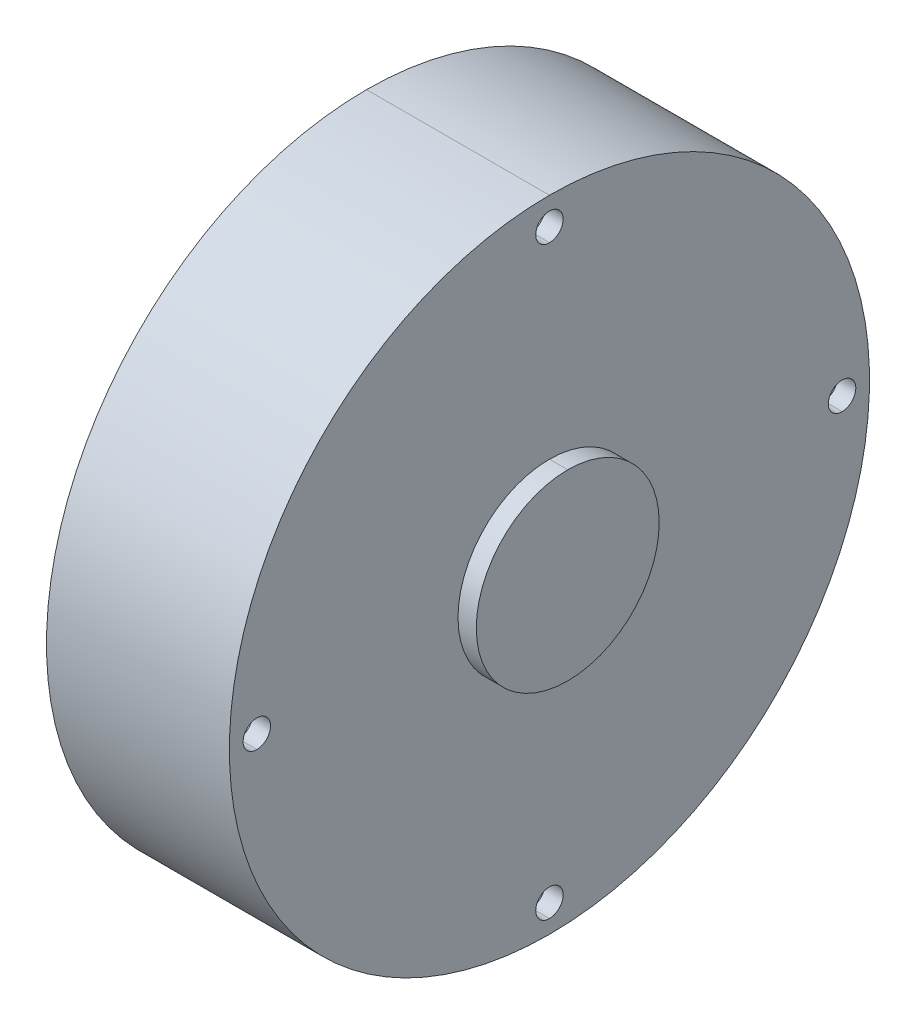
ISO-10303-21;
HEADER;
FILE_DESCRIPTION(('STEP AP214'),'2;1');
FILE_NAME('part.step','',(''),(''),'','','');
FILE_SCHEMA(('AUTOMOTIVE_DESIGN { 1 0 10303 214 1 1 1 1 }'));
ENDSEC;
DATA;
#1=APPLICATION_CONTEXT('core data for automotive mechanical design processes');
#2=APPLICATION_PROTOCOL_DEFINITION('international standard','automotive_design',2000,#1);
#3=PRODUCT_CONTEXT('',#1,'mechanical');
#4=PRODUCT('Part','Part','',(#3));
#5=PRODUCT_RELATED_PRODUCT_CATEGORY('part','',(#4));
#6=PRODUCT_DEFINITION_FORMATION('','',#4);
#7=PRODUCT_DEFINITION_CONTEXT('part definition',#1,'design');
#8=PRODUCT_DEFINITION('design','',#6,#7);
#9=PRODUCT_DEFINITION_SHAPE('','',#8);
#10=(LENGTH_UNIT() NAMED_UNIT(*) SI_UNIT(.MILLI.,.METRE.));
#11=(NAMED_UNIT(*) PLANE_ANGLE_UNIT() SI_UNIT($,.RADIAN.));
#12=(NAMED_UNIT(*) SI_UNIT($,.STERADIAN.) SOLID_ANGLE_UNIT());
#13=UNCERTAINTY_MEASURE_WITH_UNIT(LENGTH_MEASURE(1.E-05),#10,'distance_accuracy_value','');
#14=(GEOMETRIC_REPRESENTATION_CONTEXT(3) GLOBAL_UNCERTAINTY_ASSIGNED_CONTEXT((#13)) GLOBAL_UNIT_ASSIGNED_CONTEXT((#10,
#11,#12)) REPRESENTATION_CONTEXT('',''));
#15=CARTESIAN_POINT('',(0.,0.,0.));
#16=DIRECTION('',(0.,0.,1.));
#17=DIRECTION('',(1.,0.,0.));
#18=AXIS2_PLACEMENT_3D('',#15,#16,#17);
#19=CARTESIAN_POINT('',(44.232392983244,0.,0.));
#20=DIRECTION('',(-1.,0.,0.));
#21=DIRECTION('',(0.,1.,0.));
#22=AXIS2_PLACEMENT_3D('',#19,#20,#21);
#23=CYLINDRICAL_SURFACE('',#22,7.69230769133077);
#24=DIRECTION('',(1.,0.,0.));
#25=VECTOR('',#24,1.);
#26=CARTESIAN_POINT('',(44.232392983244,7.69230769133076,0.));
#27=LINE('',#26,#25);
#28=CARTESIAN_POINT('',(43.4631622141109,7.69230769133076,0.));
#29=VERTEX_POINT('',#28);
#30=CARTESIAN_POINT('',(45.0016237523771,7.69230769133076,0.));
#31=VERTEX_POINT('',#30);
#32=EDGE_CURVE('E72',#29,#31,#27,.T.);
#33=ORIENTED_EDGE('',*,*,#32,.F.);
#34=CARTESIAN_POINT('',(43.4631622141109,0.,0.));
#35=DIRECTION('',(1.,0.,0.));
#36=DIRECTION('',(0.,1.,0.));
#37=AXIS2_PLACEMENT_3D('',#34,#35,#36);
#38=CIRCLE('',#37,7.69230769133077);
#39=CARTESIAN_POINT('',(43.4631622141109,-7.69230769133078,0.));
#40=VERTEX_POINT('',#39);
#41=EDGE_CURVE('E11',#29,#40,#38,.T.);
#42=ORIENTED_EDGE('',*,*,#41,.T.);
#43=DIRECTION('',(1.,0.,0.));
#44=VECTOR('',#43,1.);
#45=CARTESIAN_POINT('',(44.232392983244,-7.69230769133078,0.));
#46=LINE('',#45,#44);
#47=CARTESIAN_POINT('',(45.0016237523771,-7.69230769133078,0.));
#48=VERTEX_POINT('',#47);
#49=EDGE_CURVE('E59',#40,#48,#46,.T.);
#50=ORIENTED_EDGE('',*,*,#49,.T.);
#51=CARTESIAN_POINT('',(45.0016237523771,0.,0.));
#52=DIRECTION('',(1.,0.,0.));
#53=DIRECTION('',(0.,1.,0.));
#54=AXIS2_PLACEMENT_3D('',#51,#52,#53);
#55=CIRCLE('',#54,7.69230769133077);
#56=EDGE_CURVE('E327',#31,#48,#55,.T.);
#57=ORIENTED_EDGE('',*,*,#56,.F.);
#58=EDGE_LOOP('',(#33,#42,#50,#57));
#59=FACE_BOUND('',#58,.T.);
#60=ADVANCED_FACE('F48',(#59),#23,.T.);
#61=CARTESIAN_POINT('',(44.232392983244,0.,0.));
#62=DIRECTION('',(-1.,0.,0.));
#63=DIRECTION('',(0.,1.,0.));
#64=AXIS2_PLACEMENT_3D('',#61,#62,#63);
#65=CYLINDRICAL_SURFACE('',#64,7.69230769133077);
#66=ORIENTED_EDGE('',*,*,#49,.F.);
#67=CARTESIAN_POINT('',(43.4631622141109,0.,0.));
#68=DIRECTION('',(1.,0.,0.));
#69=DIRECTION('',(0.,1.,0.));
#70=AXIS2_PLACEMENT_3D('',#67,#68,#69);
#71=CIRCLE('',#70,7.69230769133077);
#72=EDGE_CURVE('E290',#40,#29,#71,.T.);
#73=ORIENTED_EDGE('',*,*,#72,.T.);
#74=ORIENTED_EDGE('',*,*,#32,.T.);
#75=CARTESIAN_POINT('',(45.0016237523771,0.,0.));
#76=DIRECTION('',(1.,0.,0.));
#77=DIRECTION('',(0.,1.,0.));
#78=AXIS2_PLACEMENT_3D('',#75,#76,#77);
#79=CIRCLE('',#78,7.69230769133077);
#80=EDGE_CURVE('E334',#48,#31,#79,.T.);
#81=ORIENTED_EDGE('',*,*,#80,.F.);
#82=EDGE_LOOP('',(#66,#73,#74,#81));
#83=FACE_BOUND('',#82,.T.);
#84=ADVANCED_FACE('F50',(#83),#65,.T.);
#85=CARTESIAN_POINT('',(45.0016237523771,0.,0.));
#86=DIRECTION('',(1.,0.,0.));
#87=DIRECTION('',(0.,1.,0.));
#88=AXIS2_PLACEMENT_3D('',#85,#86,#87);
#89=PLANE('',#88);
#90=ORIENTED_EDGE('',*,*,#56,.T.);
#91=ORIENTED_EDGE('',*,*,#80,.T.);
#92=EDGE_LOOP('',(#90,#91));
#93=FACE_BOUND('',#92,.T.);
#94=ADVANCED_FACE('F628',(#93),#89,.T.);
#95=CARTESIAN_POINT('',(43.4631622141109,0.,0.));
#96=DIRECTION('',(1.,0.,0.));
#97=DIRECTION('',(0.,1.,0.));
#98=AXIS2_PLACEMENT_3D('',#95,#96,#97);
#99=PLANE('',#98);
#100=CARTESIAN_POINT('',(43.4631622141109,0.,0.));
#101=DIRECTION('',(1.,0.,0.));
#102=DIRECTION('',(0.,1.,0.));
#103=AXIS2_PLACEMENT_3D('',#100,#101,#102);
#104=CIRCLE('',#103,3.84615384566538);
#105=CARTESIAN_POINT('',(43.4631622141109,3.84615384566537,0.));
#106=VERTEX_POINT('',#105);
#107=CARTESIAN_POINT('',(43.4631622141109,-3.8461538456654,0.));
#108=VERTEX_POINT('',#107);
#109=EDGE_CURVE('E338',#106,#108,#104,.T.);
#110=ORIENTED_EDGE('',*,*,#109,.F.);
#111=CARTESIAN_POINT('',(43.4631622141109,0.,0.));
#112=DIRECTION('',(1.,0.,0.));
#113=DIRECTION('',(0.,1.,0.));
#114=AXIS2_PLACEMENT_3D('',#111,#112,#113);
#115=CIRCLE('',#114,3.84615384566538);
#116=EDGE_CURVE('E283',#108,#106,#115,.T.);
#117=ORIENTED_EDGE('',*,*,#116,.F.);
#118=EDGE_LOOP('',(#110,#117));
#119=FACE_BOUND('',#118,.T.);
#120=ADVANCED_FACE('F622',(#119),#99,.F.);
#121=CARTESIAN_POINT('',(35.7708545227802,0.,0.));
#122=DIRECTION('',(-1.,0.,0.));
#123=DIRECTION('',(0.,1.,0.));
#124=AXIS2_PLACEMENT_3D('',#121,#122,#123);
#125=CYLINDRICAL_SURFACE('',#124,26.9230769196577);
#126=DIRECTION('',(1.,0.,0.));
#127=VECTOR('',#126,1.);
#128=CARTESIAN_POINT('',(35.7708545227802,26.9230769196577,0.));
#129=LINE('',#128,#127);
#130=CARTESIAN_POINT('',(28.0785468314494,26.9230769196577,0.));
#131=VERTEX_POINT('',#130);
#132=CARTESIAN_POINT('',(43.4631622141109,26.9230769196577,0.));
#133=VERTEX_POINT('',#132);
#134=EDGE_CURVE('E314',#131,#133,#129,.T.);
#135=ORIENTED_EDGE('',*,*,#134,.F.);
#136=CARTESIAN_POINT('',(28.0785468314494,0.,0.));
#137=DIRECTION('',(1.,0.,0.));
#138=DIRECTION('',(0.,1.,0.));
#139=AXIS2_PLACEMENT_3D('',#136,#137,#138);
#140=CIRCLE('',#139,26.9230769196577);
#141=CARTESIAN_POINT('',(28.0785468314494,-26.9230769196577,0.));
#142=VERTEX_POINT('',#141);
#143=EDGE_CURVE('E234',#131,#142,#140,.T.);
#144=ORIENTED_EDGE('',*,*,#143,.T.);
#145=DIRECTION('',(1.,0.,0.));
#146=VECTOR('',#145,1.);
#147=CARTESIAN_POINT('',(35.7708545227802,-26.9230769196577,0.));
#148=LINE('',#147,#146);
#149=CARTESIAN_POINT('',(43.4631622141109,-26.9230769196577,0.));
#150=VERTEX_POINT('',#149);
#151=EDGE_CURVE('E230',#142,#150,#148,.T.);
#152=ORIENTED_EDGE('',*,*,#151,.T.);
#153=CARTESIAN_POINT('',(43.4631622141109,0.,0.));
#154=DIRECTION('',(1.,0.,0.));
#155=DIRECTION('',(0.,1.,0.));
#156=AXIS2_PLACEMENT_3D('',#153,#154,#155);
#157=CIRCLE('',#156,26.9230769196577);
#158=EDGE_CURVE('E288',#133,#150,#157,.T.);
#159=ORIENTED_EDGE('',*,*,#158,.F.);
#160=EDGE_LOOP('',(#135,#144,#152,#159));
#161=FACE_BOUND('',#160,.T.);
#162=ADVANCED_FACE('F703',(#161),#125,.T.);
#163=CARTESIAN_POINT('',(35.7708545227802,0.,0.));
#164=DIRECTION('',(-1.,0.,0.));
#165=DIRECTION('',(0.,1.,0.));
#166=AXIS2_PLACEMENT_3D('',#163,#164,#165);
#167=CYLINDRICAL_SURFACE('',#166,26.9230769196577);
#168=ORIENTED_EDGE('',*,*,#151,.F.);
#169=CARTESIAN_POINT('',(28.0785468314494,0.,0.));
#170=DIRECTION('',(1.,0.,0.));
#171=DIRECTION('',(0.,1.,0.));
#172=AXIS2_PLACEMENT_3D('',#169,#170,#171);
#173=CIRCLE('',#172,26.9230769196577);
#174=EDGE_CURVE('E235',#142,#131,#173,.T.);
#175=ORIENTED_EDGE('',*,*,#174,.T.);
#176=ORIENTED_EDGE('',*,*,#134,.T.);
#177=CARTESIAN_POINT('',(43.4631622141109,0.,0.));
#178=DIRECTION('',(1.,0.,0.));
#179=DIRECTION('',(0.,1.,0.));
#180=AXIS2_PLACEMENT_3D('',#177,#178,#179);
#181=CIRCLE('',#180,26.9230769196577);
#182=EDGE_CURVE('E284',#150,#133,#181,.T.);
#183=ORIENTED_EDGE('',*,*,#182,.F.);
#184=EDGE_LOOP('',(#168,#175,#176,#183));
#185=FACE_BOUND('',#184,.T.);
#186=ADVANCED_FACE('F592',(#185),#167,.T.);
#187=CARTESIAN_POINT('',(28.0785468314494,0.,0.));
#188=DIRECTION('',(1.,0.,0.));
#189=DIRECTION('',(0.,1.,0.));
#190=AXIS2_PLACEMENT_3D('',#187,#188,#189);
#191=PLANE('',#190);
#192=ORIENTED_EDGE('',*,*,#174,.F.);
#193=ORIENTED_EDGE('',*,*,#143,.F.);
#194=EDGE_LOOP('',(#192,#193));
#195=FACE_BOUND('',#194,.T.);
#196=CARTESIAN_POINT('',(28.0785468314494,0.,0.));
#197=DIRECTION('',(-1.,0.,0.));
#198=DIRECTION('',(0.,-1.,0.));
#199=AXIS2_PLACEMENT_3D('',#196,#197,#198);
#200=CIRCLE('',#199,26.1538461505246);
#201=CARTESIAN_POINT('',(28.0785468314494,26.1538461505246,0.));
#202=VERTEX_POINT('',#201);
#203=CARTESIAN_POINT('',(28.0785468314494,-26.1538461505246,0.));
#204=VERTEX_POINT('',#203);
#205=EDGE_CURVE('E228',#202,#204,#200,.T.);
#206=ORIENTED_EDGE('',*,*,#205,.F.);
#207=CARTESIAN_POINT('',(28.0785468314494,0.,0.));
#208=DIRECTION('',(-1.,0.,0.));
#209=DIRECTION('',(0.,-1.,0.));
#210=AXIS2_PLACEMENT_3D('',#207,#208,#209);
#211=CIRCLE('',#210,26.1538461505246);
#212=EDGE_CURVE('E289',#204,#202,#211,.T.);
#213=ORIENTED_EDGE('',*,*,#212,.F.);
#214=EDGE_LOOP('',(#206,#213));
#215=FACE_BOUND('',#214,.T.);
#216=ADVANCED_FACE('F396',(#195,#215),#191,.F.);
#217=CARTESIAN_POINT('',(43.4631622141109,0.,0.));
#218=DIRECTION('',(1.,0.,0.));
#219=DIRECTION('',(0.,1.,0.));
#220=AXIS2_PLACEMENT_3D('',#217,#218,#219);
#221=PLANE('',#220);
#222=ORIENTED_EDGE('',*,*,#158,.T.);
#223=ORIENTED_EDGE('',*,*,#182,.T.);
#224=EDGE_LOOP('',(#222,#223));
#225=FACE_BOUND('',#224,.T.);
#226=ORIENTED_EDGE('',*,*,#41,.F.);
#227=ORIENTED_EDGE('',*,*,#72,.F.);
#228=EDGE_LOOP('',(#226,#227));
#229=FACE_BOUND('',#228,.T.);
#230=CARTESIAN_POINT('',(43.4631622141109,-24.6153846122585,0.));
#231=DIRECTION('',(1.,0.,0.));
#232=DIRECTION('',(0.,1.,0.));
#233=AXIS2_PLACEMENT_3D('',#230,#231,#232);
#234=CIRCLE('',#233,1.15384615369961);
#235=CARTESIAN_POINT('',(43.4631622141109,-23.4615384585589,0.));
#236=VERTEX_POINT('',#235);
#237=CARTESIAN_POINT('',(43.4631622141109,-25.7692307659581,0.));
#238=VERTEX_POINT('',#237);
#239=EDGE_CURVE('E298',#236,#238,#234,.T.);
#240=ORIENTED_EDGE('',*,*,#239,.F.);
#241=CARTESIAN_POINT('',(43.4631622141109,-24.6153846122585,0.));
#242=DIRECTION('',(1.,0.,0.));
#243=DIRECTION('',(0.,1.,0.));
#244=AXIS2_PLACEMENT_3D('',#241,#242,#243);
#245=CIRCLE('',#244,1.15384615369961);
#246=EDGE_CURVE('E299',#238,#236,#245,.T.);
#247=ORIENTED_EDGE('',*,*,#246,.F.);
#248=EDGE_LOOP('',(#240,#247));
#249=FACE_BOUND('',#248,.T.);
#250=CARTESIAN_POINT('',(43.4631622141109,24.6153846122584,0.));
#251=DIRECTION('',(1.,0.,0.));
#252=DIRECTION('',(0.,1.,0.));
#253=AXIS2_PLACEMENT_3D('',#250,#251,#252);
#254=CIRCLE('',#253,1.15384615369961);
#255=CARTESIAN_POINT('',(43.4631622141109,25.7692307659581,0.));
#256=VERTEX_POINT('',#255);
#257=CARTESIAN_POINT('',(43.4631622141109,23.4615384585588,0.));
#258=VERTEX_POINT('',#257);
#259=EDGE_CURVE('E204',#256,#258,#254,.T.);
#260=ORIENTED_EDGE('',*,*,#259,.F.);
#261=CARTESIAN_POINT('',(43.4631622141109,24.6153846122585,0.));
#262=DIRECTION('',(1.,0.,0.));
#263=DIRECTION('',(0.,1.,0.));
#264=AXIS2_PLACEMENT_3D('',#261,#262,#263);
#265=CIRCLE('',#264,1.15384615369961);
#266=EDGE_CURVE('E220',#258,#256,#265,.T.);
#267=ORIENTED_EDGE('',*,*,#266,.F.);
#268=EDGE_LOOP('',(#260,#267));
#269=FACE_BOUND('',#268,.T.);
#270=CARTESIAN_POINT('',(43.4631622141109,0.,24.6153846122585));
#271=DIRECTION('',(1.,0.,0.));
#272=DIRECTION('',(0.,1.,0.));
#273=AXIS2_PLACEMENT_3D('',#270,#271,#272);
#274=CIRCLE('',#273,1.15384615369961);
#275=CARTESIAN_POINT('',(43.4631622141109,1.1538461536996,24.6153846122585));
#276=VERTEX_POINT('',#275);
#277=CARTESIAN_POINT('',(43.4631622141109,-1.15384615369963,24.6153846122585));
#278=VERTEX_POINT('',#277);
#279=EDGE_CURVE('E209',#276,#278,#274,.T.);
#280=ORIENTED_EDGE('',*,*,#279,.F.);
#281=CARTESIAN_POINT('',(43.4631622141109,0.,24.6153846122585));
#282=DIRECTION('',(1.,0.,0.));
#283=DIRECTION('',(0.,1.,0.));
#284=AXIS2_PLACEMENT_3D('',#281,#282,#283);
#285=CIRCLE('',#284,1.15384615369961);
#286=EDGE_CURVE('E241',#278,#276,#285,.T.);
#287=ORIENTED_EDGE('',*,*,#286,.F.);
#288=EDGE_LOOP('',(#280,#287));
#289=FACE_BOUND('',#288,.T.);
#290=CARTESIAN_POINT('',(43.4631622141109,0.,-24.6153846122584));
#291=DIRECTION('',(1.,0.,0.));
#292=DIRECTION('',(0.,1.,0.));
#293=AXIS2_PLACEMENT_3D('',#290,#291,#292);
#294=CIRCLE('',#293,1.15384615369961);
#295=CARTESIAN_POINT('',(43.4631622141109,1.1538461536996,-24.6153846122584));
#296=VERTEX_POINT('',#295);
#297=CARTESIAN_POINT('',(43.4631622141109,-1.15384615369963,-24.6153846122584));
#298=VERTEX_POINT('',#297);
#299=EDGE_CURVE('E255',#296,#298,#294,.T.);
#300=ORIENTED_EDGE('',*,*,#299,.F.);
#301=CARTESIAN_POINT('',(43.4631622141109,0.,-24.6153846122584));
#302=DIRECTION('',(1.,0.,0.));
#303=DIRECTION('',(0.,1.,0.));
#304=AXIS2_PLACEMENT_3D('',#301,#302,#303);
#305=CIRCLE('',#304,1.15384615369961);
#306=EDGE_CURVE('E236',#298,#296,#305,.T.);
#307=ORIENTED_EDGE('',*,*,#306,.F.);
#308=EDGE_LOOP('',(#300,#307));
#309=FACE_BOUND('',#308,.T.);
#310=ADVANCED_FACE('F574',(#225,#229,#249,#269,#289,#309),#221,.T.);
#311=CARTESIAN_POINT('',(35.0016237536471,0.,0.));
#312=DIRECTION('',(1.,0.,0.));
#313=DIRECTION('',(0.,-1.,0.));
#314=AXIS2_PLACEMENT_3D('',#311,#312,#313);
#315=CYLINDRICAL_SURFACE('',#314,26.1538461505246);
#316=DIRECTION('',(1.,0.,0.));
#317=VECTOR('',#316,1.);
#318=CARTESIAN_POINT('',(35.0016237536471,-26.1538461505246,0.));
#319=LINE('',#318,#317);
#320=CARTESIAN_POINT('',(41.9247006758448,-26.1538461505246,0.));
#321=VERTEX_POINT('',#320);
#322=EDGE_CURVE('E294',#204,#321,#319,.T.);
#323=ORIENTED_EDGE('',*,*,#322,.F.);
#324=ORIENTED_EDGE('',*,*,#212,.T.);
#325=DIRECTION('',(1.,0.,0.));
#326=VECTOR('',#325,1.);
#327=CARTESIAN_POINT('',(35.0016237536471,26.1538461505246,0.));
#328=LINE('',#327,#326);
#329=CARTESIAN_POINT('',(41.9247006758448,26.1538461505246,0.));
#330=VERTEX_POINT('',#329);
#331=EDGE_CURVE('E307',#202,#330,#328,.T.);
#332=ORIENTED_EDGE('',*,*,#331,.T.);
#333=CARTESIAN_POINT('',(41.9247006758448,0.,0.));
#334=DIRECTION('',(-1.,0.,0.));
#335=DIRECTION('',(0.,-1.,0.));
#336=AXIS2_PLACEMENT_3D('',#333,#334,#335);
#337=CIRCLE('',#336,26.1538461505246);
#338=EDGE_CURVE('E370',#321,#330,#337,.T.);
#339=ORIENTED_EDGE('',*,*,#338,.F.);
#340=EDGE_LOOP('',(#323,#324,#332,#339));
#341=FACE_BOUND('',#340,.T.);
#342=ADVANCED_FACE('F393',(#341),#315,.F.);
#343=CARTESIAN_POINT('',(35.0016237536471,0.,0.));
#344=DIRECTION('',(1.,0.,0.));
#345=DIRECTION('',(0.,-1.,0.));
#346=AXIS2_PLACEMENT_3D('',#343,#344,#345);
#347=CYLINDRICAL_SURFACE('',#346,26.1538461505246);
#348=ORIENTED_EDGE('',*,*,#331,.F.);
#349=ORIENTED_EDGE('',*,*,#205,.T.);
#350=ORIENTED_EDGE('',*,*,#322,.T.);
#351=CARTESIAN_POINT('',(41.9247006758448,0.,0.));
#352=DIRECTION('',(-1.,0.,0.));
#353=DIRECTION('',(0.,-1.,0.));
#354=AXIS2_PLACEMENT_3D('',#351,#352,#353);
#355=CIRCLE('',#354,26.1538461505246);
#356=EDGE_CURVE('E342',#330,#321,#355,.T.);
#357=ORIENTED_EDGE('',*,*,#356,.F.);
#358=EDGE_LOOP('',(#348,#349,#350,#357));
#359=FACE_BOUND('',#358,.T.);
#360=ADVANCED_FACE('F388',(#359),#347,.F.);
#361=CARTESIAN_POINT('',(48.8477775980425,-24.6153846122585,0.));
#362=DIRECTION('',(1.,0.,0.));
#363=DIRECTION('',(0.,-1.,0.));
#364=AXIS2_PLACEMENT_3D('',#361,#362,#363);
#365=CYLINDRICAL_SURFACE('',#364,1.15384615369962);
#366=ORIENTED_EDGE('',*,*,#239,.T.);
#367=DIRECTION('',(1.,0.,0.));
#368=VECTOR('',#367,1.);
#369=CARTESIAN_POINT('',(48.8477775980425,-25.7692307659581,0.));
#370=LINE('',#369,#368);
#371=CARTESIAN_POINT('',(41.9247006758448,-25.7692307659581,0.));
#372=VERTEX_POINT('',#371);
#373=EDGE_CURVE('E251',#372,#238,#370,.T.);
#374=ORIENTED_EDGE('',*,*,#373,.F.);
#375=CARTESIAN_POINT('',(41.9247006758448,-24.6153846122585,0.));
#376=DIRECTION('',(-1.,0.,0.));
#377=DIRECTION('',(0.,-1.,0.));
#378=AXIS2_PLACEMENT_3D('',#375,#376,#377);
#379=CIRCLE('',#378,1.15384615369962);
#380=CARTESIAN_POINT('',(41.9247006758448,-23.4615384585589,0.));
#381=VERTEX_POINT('',#380);
#382=EDGE_CURVE('E321',#372,#381,#379,.T.);
#383=ORIENTED_EDGE('',*,*,#382,.T.);
#384=DIRECTION('',(1.,0.,0.));
#385=VECTOR('',#384,1.);
#386=CARTESIAN_POINT('',(48.8477775980425,-23.4615384585589,0.));
#387=LINE('',#386,#385);
#388=EDGE_CURVE('E301',#381,#236,#387,.T.);
#389=ORIENTED_EDGE('',*,*,#388,.T.);
#390=EDGE_LOOP('',(#366,#374,#383,#389));
#391=FACE_BOUND('',#390,.T.);
#392=ADVANCED_FACE('F697',(#391),#365,.F.);
#393=CARTESIAN_POINT('',(48.8477775980425,-24.6153846122585,0.));
#394=DIRECTION('',(1.,0.,0.));
#395=DIRECTION('',(0.,-1.,0.));
#396=AXIS2_PLACEMENT_3D('',#393,#394,#395);
#397=CYLINDRICAL_SURFACE('',#396,1.15384615369962);
#398=ORIENTED_EDGE('',*,*,#246,.T.);
#399=ORIENTED_EDGE('',*,*,#388,.F.);
#400=CARTESIAN_POINT('',(41.9247006758448,-24.6153846122585,0.));
#401=DIRECTION('',(-1.,0.,0.));
#402=DIRECTION('',(0.,-1.,0.));
#403=AXIS2_PLACEMENT_3D('',#400,#401,#402);
#404=CIRCLE('',#403,1.15384615369962);
#405=EDGE_CURVE('E302',#381,#372,#404,.T.);
#406=ORIENTED_EDGE('',*,*,#405,.T.);
#407=ORIENTED_EDGE('',*,*,#373,.T.);
#408=EDGE_LOOP('',(#398,#399,#406,#407));
#409=FACE_BOUND('',#408,.T.);
#410=ADVANCED_FACE('F714',(#409),#397,.F.);
#411=CARTESIAN_POINT('',(48.8477775980425,24.6153846122584,0.));
#412=DIRECTION('',(1.,0.,0.));
#413=DIRECTION('',(0.,-1.,0.));
#414=AXIS2_PLACEMENT_3D('',#411,#412,#413);
#415=CYLINDRICAL_SURFACE('',#414,1.15384615369962);
#416=ORIENTED_EDGE('',*,*,#259,.T.);
#417=DIRECTION('',(1.,0.,0.));
#418=VECTOR('',#417,1.);
#419=CARTESIAN_POINT('',(48.8477775980425,23.4615384585588,0.));
#420=LINE('',#419,#418);
#421=CARTESIAN_POINT('',(41.9247006758448,23.4615384585588,0.));
#422=VERTEX_POINT('',#421);
#423=EDGE_CURVE('E197',#422,#258,#420,.T.);
#424=ORIENTED_EDGE('',*,*,#423,.F.);
#425=CARTESIAN_POINT('',(41.9247006758448,24.6153846122584,0.));
#426=DIRECTION('',(-1.,0.,0.));
#427=DIRECTION('',(0.,-1.,0.));
#428=AXIS2_PLACEMENT_3D('',#425,#426,#427);
#429=CIRCLE('',#428,1.15384615369962);
#430=CARTESIAN_POINT('',(41.9247006758448,25.7692307659581,0.));
#431=VERTEX_POINT('',#430);
#432=EDGE_CURVE('E52',#422,#431,#429,.T.);
#433=ORIENTED_EDGE('',*,*,#432,.T.);
#434=DIRECTION('',(1.,0.,0.));
#435=VECTOR('',#434,1.);
#436=CARTESIAN_POINT('',(48.8477775980425,25.7692307659581,0.));
#437=LINE('',#436,#435);
#438=EDGE_CURVE('E216',#431,#256,#437,.T.);
#439=ORIENTED_EDGE('',*,*,#438,.T.);
#440=EDGE_LOOP('',(#416,#424,#433,#439));
#441=FACE_BOUND('',#440,.T.);
#442=ADVANCED_FACE('F200',(#441),#415,.F.);
#443=CARTESIAN_POINT('',(48.8477775980425,24.6153846122584,0.));
#444=DIRECTION('',(1.,0.,0.));
#445=DIRECTION('',(0.,-1.,0.));
#446=AXIS2_PLACEMENT_3D('',#443,#444,#445);
#447=CYLINDRICAL_SURFACE('',#446,1.15384615369962);
#448=ORIENTED_EDGE('',*,*,#266,.T.);
#449=ORIENTED_EDGE('',*,*,#438,.F.);
#450=CARTESIAN_POINT('',(41.9247006758448,24.6153846122584,0.));
#451=DIRECTION('',(-1.,0.,0.));
#452=DIRECTION('',(0.,-1.,0.));
#453=AXIS2_PLACEMENT_3D('',#450,#451,#452);
#454=CIRCLE('',#453,1.15384615369962);
#455=EDGE_CURVE('E208',#431,#422,#454,.T.);
#456=ORIENTED_EDGE('',*,*,#455,.T.);
#457=ORIENTED_EDGE('',*,*,#423,.T.);
#458=EDGE_LOOP('',(#448,#449,#456,#457));
#459=FACE_BOUND('',#458,.T.);
#460=ADVANCED_FACE('F218',(#459),#447,.F.);
#461=CARTESIAN_POINT('',(48.8477775980425,0.,24.6153846122585));
#462=DIRECTION('',(1.,0.,0.));
#463=DIRECTION('',(0.,-1.,0.));
#464=AXIS2_PLACEMENT_3D('',#461,#462,#463);
#465=CYLINDRICAL_SURFACE('',#464,1.15384615369961);
#466=ORIENTED_EDGE('',*,*,#279,.T.);
#467=DIRECTION('',(1.,0.,0.));
#468=VECTOR('',#467,1.);
#469=CARTESIAN_POINT('',(48.8477775980425,-1.15384615369963,24.6153846122585));
#470=LINE('',#469,#468);
#471=CARTESIAN_POINT('',(41.9247006758448,-1.15384615369963,24.6153846122585));
#472=VERTEX_POINT('',#471);
#473=EDGE_CURVE('E252',#472,#278,#470,.T.);
#474=ORIENTED_EDGE('',*,*,#473,.F.);
#475=CARTESIAN_POINT('',(41.9247006758448,0.,24.6153846122585));
#476=DIRECTION('',(-1.,0.,0.));
#477=DIRECTION('',(0.,-1.,0.));
#478=AXIS2_PLACEMENT_3D('',#475,#476,#477);
#479=CIRCLE('',#478,1.15384615369961);
#480=CARTESIAN_POINT('',(41.9247006758448,1.1538461536996,24.6153846122585));
#481=VERTEX_POINT('',#480);
#482=EDGE_CURVE('E246',#472,#481,#479,.T.);
#483=ORIENTED_EDGE('',*,*,#482,.T.);
#484=DIRECTION('',(1.,0.,0.));
#485=VECTOR('',#484,1.);
#486=CARTESIAN_POINT('',(48.8477775980425,1.1538461536996,24.6153846122585));
#487=LINE('',#486,#485);
#488=EDGE_CURVE('E244',#481,#276,#487,.T.);
#489=ORIENTED_EDGE('',*,*,#488,.T.);
#490=EDGE_LOOP('',(#466,#474,#483,#489));
#491=FACE_BOUND('',#490,.T.);
#492=ADVANCED_FACE('F598',(#491),#465,.F.);
#493=CARTESIAN_POINT('',(48.8477775980425,0.,24.6153846122585));
#494=DIRECTION('',(1.,0.,0.));
#495=DIRECTION('',(0.,-1.,0.));
#496=AXIS2_PLACEMENT_3D('',#493,#494,#495);
#497=CYLINDRICAL_SURFACE('',#496,1.15384615369961);
#498=ORIENTED_EDGE('',*,*,#286,.T.);
#499=ORIENTED_EDGE('',*,*,#488,.F.);
#500=CARTESIAN_POINT('',(41.9247006758448,0.,24.6153846122585));
#501=DIRECTION('',(-1.,0.,0.));
#502=DIRECTION('',(0.,-1.,0.));
#503=AXIS2_PLACEMENT_3D('',#500,#501,#502);
#504=CIRCLE('',#503,1.15384615369961);
#505=EDGE_CURVE('E245',#481,#472,#504,.T.);
#506=ORIENTED_EDGE('',*,*,#505,.T.);
#507=ORIENTED_EDGE('',*,*,#473,.T.);
#508=EDGE_LOOP('',(#498,#499,#506,#507));
#509=FACE_BOUND('',#508,.T.);
#510=ADVANCED_FACE('F685',(#509),#497,.F.);
#511=CARTESIAN_POINT('',(48.8477775980425,0.,-24.6153846122584));
#512=DIRECTION('',(1.,0.,0.));
#513=DIRECTION('',(0.,-1.,0.));
#514=AXIS2_PLACEMENT_3D('',#511,#512,#513);
#515=CYLINDRICAL_SURFACE('',#514,1.15384615369961);
#516=ORIENTED_EDGE('',*,*,#299,.T.);
#517=DIRECTION('',(1.,0.,0.));
#518=VECTOR('',#517,1.);
#519=CARTESIAN_POINT('',(48.8477775980425,-1.15384615369963,-24.6153846122584));
#520=LINE('',#519,#518);
#521=CARTESIAN_POINT('',(41.9247006758448,-1.15384615369963,-24.6153846122584));
#522=VERTEX_POINT('',#521);
#523=EDGE_CURVE('E362',#522,#298,#520,.T.);
#524=ORIENTED_EDGE('',*,*,#523,.F.);
#525=CARTESIAN_POINT('',(41.9247006758448,0.,-24.6153846122584));
#526=DIRECTION('',(-1.,0.,0.));
#527=DIRECTION('',(0.,-1.,0.));
#528=AXIS2_PLACEMENT_3D('',#525,#526,#527);
#529=CIRCLE('',#528,1.15384615369961);
#530=CARTESIAN_POINT('',(41.9247006758448,1.1538461536996,-24.6153846122584));
#531=VERTEX_POINT('',#530);
#532=EDGE_CURVE('E264',#522,#531,#529,.T.);
#533=ORIENTED_EDGE('',*,*,#532,.T.);
#534=DIRECTION('',(1.,0.,0.));
#535=VECTOR('',#534,1.);
#536=CARTESIAN_POINT('',(48.8477775980425,1.1538461536996,-24.6153846122584));
#537=LINE('',#536,#535);
#538=EDGE_CURVE('E239',#531,#296,#537,.T.);
#539=ORIENTED_EDGE('',*,*,#538,.T.);
#540=EDGE_LOOP('',(#516,#524,#533,#539));
#541=FACE_BOUND('',#540,.T.);
#542=ADVANCED_FACE('F708',(#541),#515,.F.);
#543=CARTESIAN_POINT('',(48.8477775980425,0.,-24.6153846122584));
#544=DIRECTION('',(1.,0.,0.));
#545=DIRECTION('',(0.,-1.,0.));
#546=AXIS2_PLACEMENT_3D('',#543,#544,#545);
#547=CYLINDRICAL_SURFACE('',#546,1.15384615369961);
#548=ORIENTED_EDGE('',*,*,#306,.T.);
#549=ORIENTED_EDGE('',*,*,#538,.F.);
#550=CARTESIAN_POINT('',(41.9247006758448,0.,-24.6153846122584));
#551=DIRECTION('',(-1.,0.,0.));
#552=DIRECTION('',(0.,-1.,0.));
#553=AXIS2_PLACEMENT_3D('',#550,#551,#552);
#554=CIRCLE('',#553,1.15384615369961);
#555=EDGE_CURVE('E240',#531,#522,#554,.T.);
#556=ORIENTED_EDGE('',*,*,#555,.T.);
#557=ORIENTED_EDGE('',*,*,#523,.T.);
#558=EDGE_LOOP('',(#548,#549,#556,#557));
#559=FACE_BOUND('',#558,.T.);
#560=ADVANCED_FACE('F658',(#559),#547,.F.);
#561=CARTESIAN_POINT('',(41.9247006758448,0.,0.));
#562=DIRECTION('',(-1.,0.,0.));
#563=DIRECTION('',(0.,-1.,0.));
#564=AXIS2_PLACEMENT_3D('',#561,#562,#563);
#565=PLANE('',#564);
#566=ORIENTED_EDGE('',*,*,#338,.T.);
#567=ORIENTED_EDGE('',*,*,#356,.T.);
#568=EDGE_LOOP('',(#566,#567));
#569=FACE_BOUND('',#568,.T.);
#570=ORIENTED_EDGE('',*,*,#382,.F.);
#571=ORIENTED_EDGE('',*,*,#405,.F.);
#572=EDGE_LOOP('',(#570,#571));
#573=FACE_BOUND('',#572,.T.);
#574=ORIENTED_EDGE('',*,*,#432,.F.);
#575=ORIENTED_EDGE('',*,*,#455,.F.);
#576=EDGE_LOOP('',(#574,#575));
#577=FACE_BOUND('',#576,.T.);
#578=ORIENTED_EDGE('',*,*,#482,.F.);
#579=ORIENTED_EDGE('',*,*,#505,.F.);
#580=EDGE_LOOP('',(#578,#579));
#581=FACE_BOUND('',#580,.T.);
#582=ORIENTED_EDGE('',*,*,#532,.F.);
#583=ORIENTED_EDGE('',*,*,#555,.F.);
#584=EDGE_LOOP('',(#582,#583));
#585=FACE_BOUND('',#584,.T.);
#586=CARTESIAN_POINT('',(41.9247006758448,0.,0.));
#587=DIRECTION('',(-1.,0.,0.));
#588=DIRECTION('',(0.,-1.,0.));
#589=AXIS2_PLACEMENT_3D('',#586,#587,#588);
#590=CIRCLE('',#589,3.84615384566538);
#591=CARTESIAN_POINT('',(41.9247006758448,-3.8461538456654,0.));
#592=VERTEX_POINT('',#591);
#593=CARTESIAN_POINT('',(41.9247006758448,3.84615384566537,0.));
#594=VERTEX_POINT('',#593);
#595=EDGE_CURVE('E282',#592,#594,#590,.T.);
#596=ORIENTED_EDGE('',*,*,#595,.F.);
#597=CARTESIAN_POINT('',(41.9247006758448,0.,0.));
#598=DIRECTION('',(-1.,0.,0.));
#599=DIRECTION('',(0.,-1.,0.));
#600=AXIS2_PLACEMENT_3D('',#597,#598,#599);
#601=CIRCLE('',#600,3.84615384566538);
#602=EDGE_CURVE('E355',#594,#592,#601,.T.);
#603=ORIENTED_EDGE('',*,*,#602,.F.);
#604=EDGE_LOOP('',(#596,#603));
#605=FACE_BOUND('',#604,.T.);
#606=ADVANCED_FACE('F213',(#569,#573,#577,#581,#585,#605),#565,.T.);
#607=CARTESIAN_POINT('',(48.8477775980425,0.,0.));
#608=DIRECTION('',(1.,0.,0.));
#609=DIRECTION('',(0.,-1.,0.));
#610=AXIS2_PLACEMENT_3D('',#607,#608,#609);
#611=CYLINDRICAL_SURFACE('',#610,3.84615384566538);
#612=ORIENTED_EDGE('',*,*,#109,.T.);
#613=DIRECTION('',(1.,0.,0.));
#614=VECTOR('',#613,1.);
#615=CARTESIAN_POINT('',(48.8477775980425,-3.8461538456654,0.));
#616=LINE('',#615,#614);
#617=EDGE_CURVE('E366',#592,#108,#616,.T.);
#618=ORIENTED_EDGE('',*,*,#617,.F.);
#619=ORIENTED_EDGE('',*,*,#595,.T.);
#620=DIRECTION('',(1.,0.,0.));
#621=VECTOR('',#620,1.);
#622=CARTESIAN_POINT('',(48.8477775980425,3.84615384566537,0.));
#623=LINE('',#622,#621);
#624=EDGE_CURVE('E278',#594,#106,#623,.T.);
#625=ORIENTED_EDGE('',*,*,#624,.T.);
#626=EDGE_LOOP('',(#612,#618,#619,#625));
#627=FACE_BOUND('',#626,.T.);
#628=ADVANCED_FACE('F604',(#627),#611,.F.);
#629=CARTESIAN_POINT('',(48.8477775980425,0.,0.));
#630=DIRECTION('',(1.,0.,0.));
#631=DIRECTION('',(0.,-1.,0.));
#632=AXIS2_PLACEMENT_3D('',#629,#630,#631);
#633=CYLINDRICAL_SURFACE('',#632,3.84615384566538);
#634=ORIENTED_EDGE('',*,*,#116,.T.);
#635=ORIENTED_EDGE('',*,*,#624,.F.);
#636=ORIENTED_EDGE('',*,*,#602,.T.);
#637=ORIENTED_EDGE('',*,*,#617,.T.);
#638=EDGE_LOOP('',(#634,#635,#636,#637));
#639=FACE_BOUND('',#638,.T.);
#640=ADVANCED_FACE('F670',(#639),#633,.F.);
#641=CLOSED_SHELL('',(#60,#84,#94,#120,#162,#186,#216,#310,#342,#360,#392,#410,#442,#460,#492,
#510,#542,#560,#606,#628,#640));
#642=MANIFOLD_SOLID_BREP('B2',#641);
#643=ADVANCED_BREP_SHAPE_REPRESENTATION('',(#18,#642),#14);
#644=SHAPE_DEFINITION_REPRESENTATION(#9,#643);
ENDSEC;
END-ISO-10303-21;
